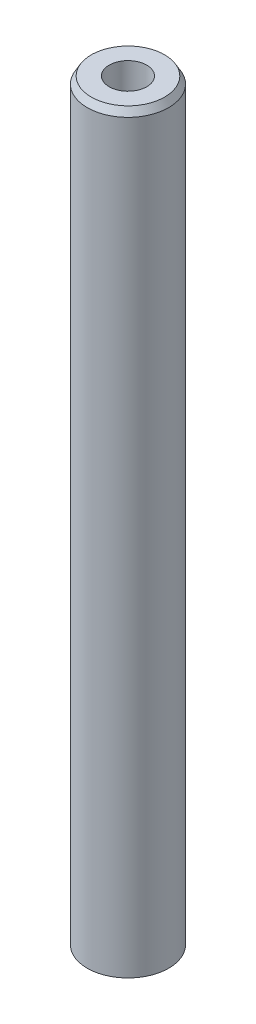
ISO-10303-21;
HEADER;
FILE_DESCRIPTION(('STEP AP214'),'2;1');
FILE_NAME('part.step','',(''),(''),'','','');
FILE_SCHEMA(('AUTOMOTIVE_DESIGN { 1 0 10303 214 1 1 1 1 }'));
ENDSEC;
DATA;
#1=APPLICATION_CONTEXT('core data for automotive mechanical design processes');
#2=APPLICATION_PROTOCOL_DEFINITION('international standard','automotive_design',2000,#1);
#3=PRODUCT_CONTEXT('',#1,'mechanical');
#4=PRODUCT('Part','Part','',(#3));
#5=PRODUCT_RELATED_PRODUCT_CATEGORY('part','',(#4));
#6=PRODUCT_DEFINITION_FORMATION('','',#4);
#7=PRODUCT_DEFINITION_CONTEXT('part definition',#1,'design');
#8=PRODUCT_DEFINITION('design','',#6,#7);
#9=PRODUCT_DEFINITION_SHAPE('','',#8);
#10=(LENGTH_UNIT() NAMED_UNIT(*) SI_UNIT(.MILLI.,.METRE.));
#11=(NAMED_UNIT(*) PLANE_ANGLE_UNIT() SI_UNIT($,.RADIAN.));
#12=(NAMED_UNIT(*) SI_UNIT($,.STERADIAN.) SOLID_ANGLE_UNIT());
#13=UNCERTAINTY_MEASURE_WITH_UNIT(LENGTH_MEASURE(1.E-05),#10,'distance_accuracy_value','');
#14=(GEOMETRIC_REPRESENTATION_CONTEXT(3) GLOBAL_UNCERTAINTY_ASSIGNED_CONTEXT((#13)) GLOBAL_UNIT_ASSIGNED_CONTEXT((#10,
#11,#12)) REPRESENTATION_CONTEXT('',''));
#15=CARTESIAN_POINT('',(0.,0.,0.));
#16=DIRECTION('',(0.,0.,1.));
#17=DIRECTION('',(1.,0.,0.));
#18=AXIS2_PLACEMENT_3D('',#15,#16,#17);
#19=CARTESIAN_POINT('',(0.,139.242795295442,0.));
#20=DIRECTION('',(0.,-1.,0.));
#21=DIRECTION('',(0.,0.,-1.));
#22=AXIS2_PLACEMENT_3D('',#19,#20,#21);
#23=CYLINDRICAL_SURFACE('',#22,7.5);
#24=CARTESIAN_POINT('',(0.,137.941669030713,0.));
#25=DIRECTION('',(0.,1.,0.));
#26=DIRECTION('',(0.,0.,1.));
#27=AXIS2_PLACEMENT_3D('',#24,#25,#26);
#28=CIRCLE('',#27,7.5);
#29=CARTESIAN_POINT('',(0.,137.941669030713,7.5));
#30=VERTEX_POINT('',#29);
#31=EDGE_CURVE('E50',#30,#30,#28,.F.);
#32=ORIENTED_EDGE('',*,*,#31,.T.);
#33=EDGE_LOOP('',(#32));
#34=FACE_BOUND('',#33,.T.);
#35=CARTESIAN_POINT('',(0.,0.75120559919073,0.));
#36=DIRECTION('',(0.,1.,0.));
#37=DIRECTION('',(0.,0.,1.));
#38=AXIS2_PLACEMENT_3D('',#35,#36,#37);
#39=CIRCLE('',#38,7.5);
#40=CARTESIAN_POINT('',(0.,0.75120559919073,7.5));
#41=VERTEX_POINT('',#40);
#42=EDGE_CURVE('E51',#41,#41,#39,.T.);
#43=ORIENTED_EDGE('',*,*,#42,.T.);
#44=EDGE_LOOP('',(#43));
#45=FACE_BOUND('',#44,.T.);
#46=ADVANCED_FACE('F39',(#34,#45),#23,.T.);
#47=CARTESIAN_POINT('',(0.,139.242795295442,0.));
#48=DIRECTION('',(0.,1.,0.));
#49=DIRECTION('',(0.,0.,1.));
#50=AXIS2_PLACEMENT_3D('',#47,#48,#49);
#51=PLANE('',#50);
#52=CARTESIAN_POINT('',(0.,139.242795295442,0.));
#53=DIRECTION('',(0.,1.,0.));
#54=DIRECTION('',(0.,0.,1.));
#55=AXIS2_PLACEMENT_3D('',#52,#53,#54);
#56=CIRCLE('',#55,6.74879440080926);
#57=CARTESIAN_POINT('',(0.,139.242795295442,6.74879440080926));
#58=VERTEX_POINT('',#57);
#59=EDGE_CURVE('E54',#58,#58,#56,.T.);
#60=ORIENTED_EDGE('',*,*,#59,.T.);
#61=EDGE_LOOP('',(#60));
#62=FACE_BOUND('',#61,.T.);
#63=CARTESIAN_POINT('',(0.,139.242795295442,0.));
#64=DIRECTION('',(0.,1.,0.));
#65=DIRECTION('',(0.,0.,1.));
#66=AXIS2_PLACEMENT_3D('',#63,#64,#65);
#67=CIRCLE('',#66,3.45885792030372);
#68=CARTESIAN_POINT('',(0.,139.242795295442,3.45885792030372));
#69=VERTEX_POINT('',#68);
#70=EDGE_CURVE('E58',#69,#69,#67,.T.);
#71=ORIENTED_EDGE('',*,*,#70,.F.);
#72=EDGE_LOOP('',(#71));
#73=FACE_BOUND('',#72,.T.);
#74=ADVANCED_FACE('F69',(#62,#73),#51,.T.);
#75=CARTESIAN_POINT('',(0.,0.,0.));
#76=DIRECTION('',(0.,1.,0.));
#77=DIRECTION('',(0.,0.,1.));
#78=AXIS2_PLACEMENT_3D('',#75,#76,#77);
#79=PLANE('',#78);
#80=CARTESIAN_POINT('',(0.,0.,0.));
#81=DIRECTION('',(0.,1.,0.));
#82=DIRECTION('',(0.,0.,1.));
#83=AXIS2_PLACEMENT_3D('',#80,#81,#82);
#84=CIRCLE('',#83,6.19887373527143);
#85=CARTESIAN_POINT('',(0.,0.,6.19887373527143));
#86=VERTEX_POINT('',#85);
#87=EDGE_CURVE('E10',#86,#86,#84,.F.);
#88=ORIENTED_EDGE('',*,*,#87,.T.);
#89=EDGE_LOOP('',(#88));
#90=FACE_BOUND('',#89,.T.);
#91=CARTESIAN_POINT('',(0.,0.,0.));
#92=DIRECTION('',(0.,1.,0.));
#93=DIRECTION('',(0.,0.,1.));
#94=AXIS2_PLACEMENT_3D('',#91,#92,#93);
#95=CIRCLE('',#94,3.45885792030372);
#96=CARTESIAN_POINT('',(0.,0.,3.45885792030372));
#97=VERTEX_POINT('',#96);
#98=EDGE_CURVE('E63',#97,#97,#95,.T.);
#99=ORIENTED_EDGE('',*,*,#98,.T.);
#100=EDGE_LOOP('',(#99));
#101=FACE_BOUND('',#100,.T.);
#102=ADVANCED_FACE('F75',(#90,#101),#79,.F.);
#103=CARTESIAN_POINT('',(0.,139.242795295442,0.));
#104=DIRECTION('',(0.,-1.,0.));
#105=DIRECTION('',(0.,0.,-1.));
#106=AXIS2_PLACEMENT_3D('',#103,#104,#105);
#107=CYLINDRICAL_SURFACE('',#106,3.45885792030372);
#108=ORIENTED_EDGE('',*,*,#70,.T.);
#109=EDGE_LOOP('',(#108));
#110=FACE_BOUND('',#109,.T.);
#111=ORIENTED_EDGE('',*,*,#98,.F.);
#112=EDGE_LOOP('',(#111));
#113=FACE_BOUND('',#112,.T.);
#114=ADVANCED_FACE('F70',(#110,#113),#107,.F.);
#115=CARTESIAN_POINT('',(0.,139.242795295442,0.));
#116=DIRECTION('',(0.,-1.,0.));
#117=DIRECTION('',(0.,0.,-1.));
#118=AXIS2_PLACEMENT_3D('',#115,#116,#117);
#119=CONICAL_SURFACE('',#118,6.74879440080926,0.523598775598296);
#120=ORIENTED_EDGE('',*,*,#31,.F.);
#121=EDGE_LOOP('',(#120));
#122=FACE_BOUND('',#121,.T.);
#123=ORIENTED_EDGE('',*,*,#59,.F.);
#124=EDGE_LOOP('',(#123));
#125=FACE_BOUND('',#124,.T.);
#126=ADVANCED_FACE('F81',(#122,#125),#119,.T.);
#127=CARTESIAN_POINT('',(0.,0.75120559919073,0.));
#128=DIRECTION('',(0.,1.,0.));
#129=DIRECTION('',(0.,0.,1.));
#130=AXIS2_PLACEMENT_3D('',#127,#128,#129);
#131=CONICAL_SURFACE('',#130,7.5,1.0471975511966);
#132=ORIENTED_EDGE('',*,*,#87,.F.);
#133=EDGE_LOOP('',(#132));
#134=FACE_BOUND('',#133,.T.);
#135=ORIENTED_EDGE('',*,*,#42,.F.);
#136=EDGE_LOOP('',(#135));
#137=FACE_BOUND('',#136,.T.);
#138=ADVANCED_FACE('F45',(#134,#137),#131,.T.);
#139=CLOSED_SHELL('',(#46,#74,#102,#114,#126,#138));
#140=MANIFOLD_SOLID_BREP('B2',#139);
#141=ADVANCED_BREP_SHAPE_REPRESENTATION('',(#18,#140),#14);
#142=SHAPE_DEFINITION_REPRESENTATION(#9,#141);
ENDSEC;
END-ISO-10303-21;
